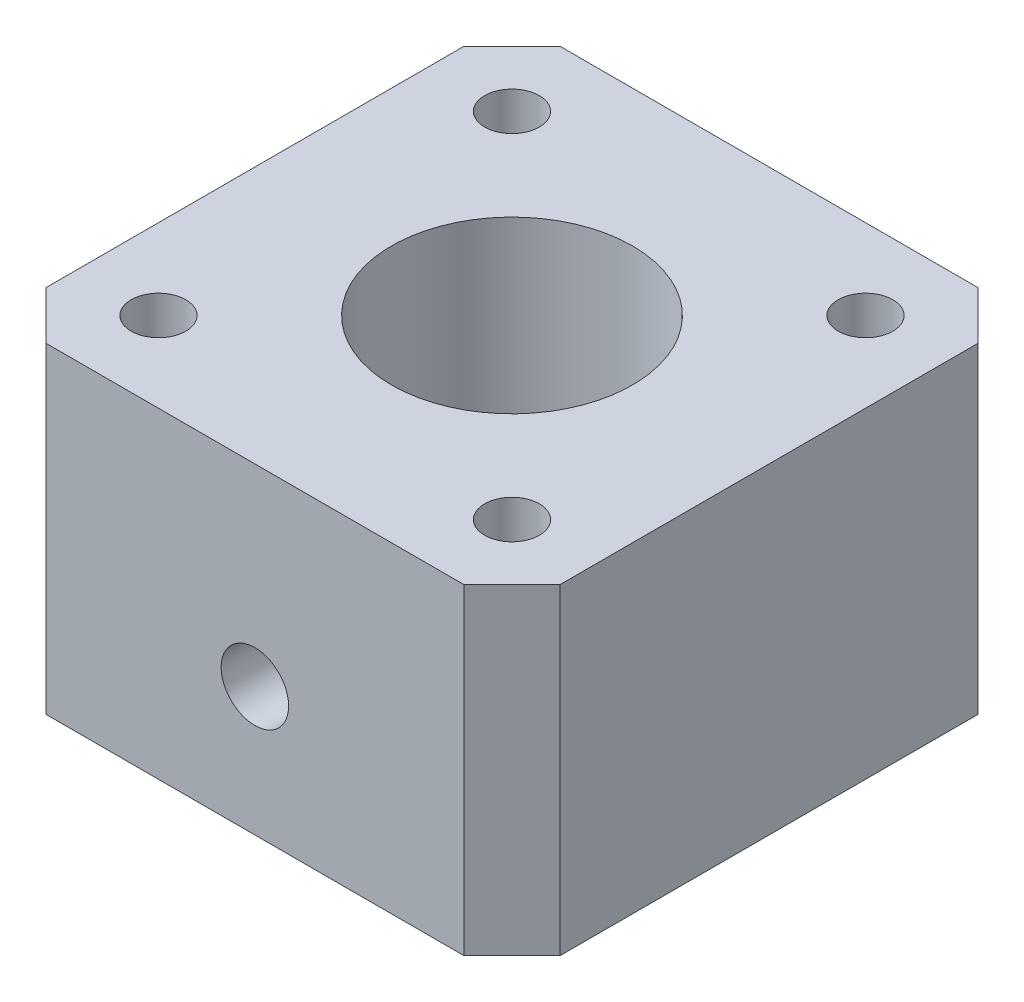
ISO-10303-21;
HEADER;
FILE_DESCRIPTION(('STEP AP214'),'2;1');
FILE_NAME('part.step','',(''),(''),'','','');
FILE_SCHEMA(('AUTOMOTIVE_DESIGN { 1 0 10303 214 1 1 1 1 }'));
ENDSEC;
DATA;
#1=APPLICATION_CONTEXT('core data for automotive mechanical design processes');
#2=APPLICATION_PROTOCOL_DEFINITION('international standard','automotive_design',2000,#1);
#3=PRODUCT_CONTEXT('',#1,'mechanical');
#4=PRODUCT('Part','Part','',(#3));
#5=PRODUCT_RELATED_PRODUCT_CATEGORY('part','',(#4));
#6=PRODUCT_DEFINITION_FORMATION('','',#4);
#7=PRODUCT_DEFINITION_CONTEXT('part definition',#1,'design');
#8=PRODUCT_DEFINITION('design','',#6,#7);
#9=PRODUCT_DEFINITION_SHAPE('','',#8);
#10=(LENGTH_UNIT() NAMED_UNIT(*) SI_UNIT(.MILLI.,.METRE.));
#11=(NAMED_UNIT(*) PLANE_ANGLE_UNIT() SI_UNIT($,.RADIAN.));
#12=(NAMED_UNIT(*) SI_UNIT($,.STERADIAN.) SOLID_ANGLE_UNIT());
#13=UNCERTAINTY_MEASURE_WITH_UNIT(LENGTH_MEASURE(1.E-05),#10,'distance_accuracy_value','');
#14=(GEOMETRIC_REPRESENTATION_CONTEXT(3) GLOBAL_UNCERTAINTY_ASSIGNED_CONTEXT((#13)) GLOBAL_UNIT_ASSIGNED_CONTEXT((#10,
#11,#12)) REPRESENTATION_CONTEXT('',''));
#15=CARTESIAN_POINT('',(0.,0.,0.));
#16=DIRECTION('',(0.,0.,1.));
#17=DIRECTION('',(1.,0.,0.));
#18=AXIS2_PLACEMENT_3D('',#15,#16,#17);
#19=CARTESIAN_POINT('',(0.,20.,0.));
#20=DIRECTION('',(0.,-1.,0.));
#21=DIRECTION('',(0.,0.,-1.));
#22=AXIS2_PLACEMENT_3D('',#19,#20,#21);
#23=PLANE('',#22);
#24=CARTESIAN_POINT('',(11.,20.,11.));
#25=DIRECTION('',(0.,-1.,0.));
#26=DIRECTION('',(0.,0.,-1.));
#27=AXIS2_PLACEMENT_3D('',#24,#25,#26);
#28=CIRCLE('',#27,1.69999999999999);
#29=CARTESIAN_POINT('',(11.,20.,9.3));
#30=VERTEX_POINT('',#29);
#31=EDGE_CURVE('E277',#30,#30,#28,.T.);
#32=ORIENTED_EDGE('',*,*,#31,.T.);
#33=EDGE_LOOP('',(#32));
#34=FACE_BOUND('',#33,.T.);
#35=CARTESIAN_POINT('',(-11.,20.,11.));
#36=DIRECTION('',(0.,-1.,0.));
#37=DIRECTION('',(0.,0.,-1.));
#38=AXIS2_PLACEMENT_3D('',#35,#36,#37);
#39=CIRCLE('',#38,1.69999999999999);
#40=CARTESIAN_POINT('',(-11.,20.,9.3));
#41=VERTEX_POINT('',#40);
#42=EDGE_CURVE('E261',#41,#41,#39,.T.);
#43=ORIENTED_EDGE('',*,*,#42,.T.);
#44=EDGE_LOOP('',(#43));
#45=FACE_BOUND('',#44,.T.);
#46=CARTESIAN_POINT('',(-11.,20.,-11.));
#47=DIRECTION('',(0.,-1.,0.));
#48=DIRECTION('',(0.,0.,-1.));
#49=AXIS2_PLACEMENT_3D('',#46,#47,#48);
#50=CIRCLE('',#49,1.69999999999999);
#51=CARTESIAN_POINT('',(-11.,20.,-12.7));
#52=VERTEX_POINT('',#51);
#53=EDGE_CURVE('E245',#52,#52,#50,.T.);
#54=ORIENTED_EDGE('',*,*,#53,.T.);
#55=EDGE_LOOP('',(#54));
#56=FACE_BOUND('',#55,.T.);
#57=CARTESIAN_POINT('',(11.,20.,-11.));
#58=DIRECTION('',(0.,-1.,0.));
#59=DIRECTION('',(0.,0.,-1.));
#60=AXIS2_PLACEMENT_3D('',#57,#58,#59);
#61=CIRCLE('',#60,1.69999999999999);
#62=CARTESIAN_POINT('',(11.,20.,-12.7));
#63=VERTEX_POINT('',#62);
#64=EDGE_CURVE('E228',#63,#63,#61,.T.);
#65=ORIENTED_EDGE('',*,*,#64,.T.);
#66=EDGE_LOOP('',(#65));
#67=FACE_BOUND('',#66,.T.);
#68=DIRECTION('',(-1.,0.,0.));
#69=VECTOR('',#68,1.);
#70=CARTESIAN_POINT('',(-16.,20.,-16.));
#71=LINE('',#70,#69);
#72=CARTESIAN_POINT('',(13.,20.,-16.));
#73=VERTEX_POINT('',#72);
#74=CARTESIAN_POINT('',(-13.,20.,-16.));
#75=VERTEX_POINT('',#74);
#76=EDGE_CURVE('E220',#73,#75,#71,.T.);
#77=ORIENTED_EDGE('',*,*,#76,.T.);
#78=DIRECTION('',(0.707106781186548,0.,-0.707106781186547));
#79=VECTOR('',#78,1.);
#80=CARTESIAN_POINT('',(-16.,20.,-13.));
#81=LINE('',#80,#79);
#82=CARTESIAN_POINT('',(-16.,20.,-13.));
#83=VERTEX_POINT('',#82);
#84=EDGE_CURVE('E189',#75,#83,#81,.F.);
#85=ORIENTED_EDGE('',*,*,#84,.T.);
#86=DIRECTION('',(0.,0.,1.));
#87=VECTOR('',#86,1.);
#88=CARTESIAN_POINT('',(-16.,20.,16.));
#89=LINE('',#88,#87);
#90=CARTESIAN_POINT('',(-16.,20.,13.));
#91=VERTEX_POINT('',#90);
#92=EDGE_CURVE('E146',#83,#91,#89,.T.);
#93=ORIENTED_EDGE('',*,*,#92,.T.);
#94=DIRECTION('',(-0.707106781186547,0.,-0.707106781186548));
#95=VECTOR('',#94,1.);
#96=CARTESIAN_POINT('',(-13.,20.,16.));
#97=LINE('',#96,#95);
#98=CARTESIAN_POINT('',(-13.,20.,16.));
#99=VERTEX_POINT('',#98);
#100=EDGE_CURVE('E82',#91,#99,#97,.F.);
#101=ORIENTED_EDGE('',*,*,#100,.T.);
#102=DIRECTION('',(1.,0.,0.));
#103=VECTOR('',#102,1.);
#104=CARTESIAN_POINT('',(-16.,20.,16.));
#105=LINE('',#104,#103);
#106=CARTESIAN_POINT('',(13.,20.,16.));
#107=VERTEX_POINT('',#106);
#108=EDGE_CURVE('E167',#99,#107,#105,.T.);
#109=ORIENTED_EDGE('',*,*,#108,.T.);
#110=DIRECTION('',(-0.707106781186549,0.,0.707106781186546));
#111=VECTOR('',#110,1.);
#112=CARTESIAN_POINT('',(16.,20.,13.));
#113=LINE('',#112,#111);
#114=CARTESIAN_POINT('',(16.,20.,13.));
#115=VERTEX_POINT('',#114);
#116=EDGE_CURVE('E181',#107,#115,#113,.F.);
#117=ORIENTED_EDGE('',*,*,#116,.T.);
#118=DIRECTION('',(0.,0.,-1.));
#119=VECTOR('',#118,1.);
#120=CARTESIAN_POINT('',(16.,20.,16.));
#121=LINE('',#120,#119);
#122=CARTESIAN_POINT('',(16.,20.,-13.));
#123=VERTEX_POINT('',#122);
#124=EDGE_CURVE('E160',#115,#123,#121,.T.);
#125=ORIENTED_EDGE('',*,*,#124,.T.);
#126=DIRECTION('',(0.707106781186546,0.,0.707106781186549));
#127=VECTOR('',#126,1.);
#128=CARTESIAN_POINT('',(13.,20.,-16.));
#129=LINE('',#128,#127);
#130=EDGE_CURVE('E184',#123,#73,#129,.F.);
#131=ORIENTED_EDGE('',*,*,#130,.T.);
#132=EDGE_LOOP('',(#77,#85,#93,#101,#109,#117,#125,#131));
#133=FACE_BOUND('',#132,.T.);
#134=CARTESIAN_POINT('',(0.,20.,0.));
#135=DIRECTION('',(0.,1.,0.));
#136=DIRECTION('',(0.,0.,1.));
#137=AXIS2_PLACEMENT_3D('',#134,#135,#136);
#138=CIRCLE('',#137,7.5);
#139=CARTESIAN_POINT('',(0.,20.,7.5));
#140=VERTEX_POINT('',#139);
#141=EDGE_CURVE('E210',#140,#140,#138,.T.);
#142=ORIENTED_EDGE('',*,*,#141,.F.);
#143=EDGE_LOOP('',(#142));
#144=FACE_BOUND('',#143,.T.);
#145=ADVANCED_FACE('F58',(#34,#45,#56,#67,#133,#144),#23,.F.);
#146=CARTESIAN_POINT('',(0.,0.,0.));
#147=DIRECTION('',(0.,-1.,0.));
#148=DIRECTION('',(0.,0.,-1.));
#149=AXIS2_PLACEMENT_3D('',#146,#147,#148);
#150=PLANE('',#149);
#151=CARTESIAN_POINT('',(11.,0.,11.));
#152=DIRECTION('',(0.,-1.,0.));
#153=DIRECTION('',(0.,0.,-1.));
#154=AXIS2_PLACEMENT_3D('',#151,#152,#153);
#155=CIRCLE('',#154,3.25);
#156=CARTESIAN_POINT('',(11.,0.,7.75));
#157=VERTEX_POINT('',#156);
#158=EDGE_CURVE('E289',#157,#157,#155,.T.);
#159=ORIENTED_EDGE('',*,*,#158,.F.);
#160=EDGE_LOOP('',(#159));
#161=FACE_BOUND('',#160,.T.);
#162=CARTESIAN_POINT('',(-11.,0.,11.));
#163=DIRECTION('',(0.,-1.,0.));
#164=DIRECTION('',(0.,0.,-1.));
#165=AXIS2_PLACEMENT_3D('',#162,#163,#164);
#166=CIRCLE('',#165,3.25);
#167=CARTESIAN_POINT('',(-11.,0.,7.75));
#168=VERTEX_POINT('',#167);
#169=EDGE_CURVE('E273',#168,#168,#166,.T.);
#170=ORIENTED_EDGE('',*,*,#169,.F.);
#171=EDGE_LOOP('',(#170));
#172=FACE_BOUND('',#171,.T.);
#173=CARTESIAN_POINT('',(-11.,0.,-11.));
#174=DIRECTION('',(0.,-1.,0.));
#175=DIRECTION('',(0.,0.,-1.));
#176=AXIS2_PLACEMENT_3D('',#173,#174,#175);
#177=CIRCLE('',#176,3.25);
#178=CARTESIAN_POINT('',(-11.,0.,-14.25));
#179=VERTEX_POINT('',#178);
#180=EDGE_CURVE('E257',#179,#179,#177,.T.);
#181=ORIENTED_EDGE('',*,*,#180,.F.);
#182=EDGE_LOOP('',(#181));
#183=FACE_BOUND('',#182,.T.);
#184=CARTESIAN_POINT('',(11.,0.,-11.));
#185=DIRECTION('',(0.,-1.,0.));
#186=DIRECTION('',(0.,0.,-1.));
#187=AXIS2_PLACEMENT_3D('',#184,#185,#186);
#188=CIRCLE('',#187,3.25);
#189=CARTESIAN_POINT('',(11.,0.,-14.25));
#190=VERTEX_POINT('',#189);
#191=EDGE_CURVE('E241',#190,#190,#188,.T.);
#192=ORIENTED_EDGE('',*,*,#191,.F.);
#193=EDGE_LOOP('',(#192));
#194=FACE_BOUND('',#193,.T.);
#195=DIRECTION('',(0.,0.,1.));
#196=VECTOR('',#195,1.);
#197=CARTESIAN_POINT('',(-16.,0.,16.));
#198=LINE('',#197,#196);
#199=CARTESIAN_POINT('',(-16.,0.,-13.));
#200=VERTEX_POINT('',#199);
#201=CARTESIAN_POINT('',(-16.,0.,13.));
#202=VERTEX_POINT('',#201);
#203=EDGE_CURVE('E144',#200,#202,#198,.T.);
#204=ORIENTED_EDGE('',*,*,#203,.F.);
#205=DIRECTION('',(-0.707106781186548,0.,0.707106781186547));
#206=VECTOR('',#205,1.);
#207=CARTESIAN_POINT('',(-14.5,0.,-14.5));
#208=LINE('',#207,#206);
#209=CARTESIAN_POINT('',(-13.,0.,-16.));
#210=VERTEX_POINT('',#209);
#211=EDGE_CURVE('E126',#200,#210,#208,.F.);
#212=ORIENTED_EDGE('',*,*,#211,.T.);
#213=DIRECTION('',(-1.,0.,0.));
#214=VECTOR('',#213,1.);
#215=CARTESIAN_POINT('',(-16.,0.,-16.));
#216=LINE('',#215,#214);
#217=CARTESIAN_POINT('',(13.,0.,-16.));
#218=VERTEX_POINT('',#217);
#219=EDGE_CURVE('E156',#218,#210,#216,.T.);
#220=ORIENTED_EDGE('',*,*,#219,.F.);
#221=DIRECTION('',(-0.707106781186546,0.,-0.707106781186549));
#222=VECTOR('',#221,1.);
#223=CARTESIAN_POINT('',(14.5,0.,-14.5));
#224=LINE('',#223,#222);
#225=CARTESIAN_POINT('',(16.,0.,-13.));
#226=VERTEX_POINT('',#225);
#227=EDGE_CURVE('E171',#218,#226,#224,.F.);
#228=ORIENTED_EDGE('',*,*,#227,.T.);
#229=DIRECTION('',(0.,0.,-1.));
#230=VECTOR('',#229,1.);
#231=CARTESIAN_POINT('',(16.,0.,16.));
#232=LINE('',#231,#230);
#233=CARTESIAN_POINT('',(16.,0.,13.));
#234=VERTEX_POINT('',#233);
#235=EDGE_CURVE('E162',#234,#226,#232,.T.);
#236=ORIENTED_EDGE('',*,*,#235,.F.);
#237=DIRECTION('',(0.707106781186549,0.,-0.707106781186546));
#238=VECTOR('',#237,1.);
#239=CARTESIAN_POINT('',(14.5,0.,14.5));
#240=LINE('',#239,#238);
#241=CARTESIAN_POINT('',(13.,0.,16.));
#242=VERTEX_POINT('',#241);
#243=EDGE_CURVE('E148',#234,#242,#240,.F.);
#244=ORIENTED_EDGE('',*,*,#243,.T.);
#245=DIRECTION('',(1.,0.,0.));
#246=VECTOR('',#245,1.);
#247=CARTESIAN_POINT('',(-16.,0.,16.));
#248=LINE('',#247,#246);
#249=CARTESIAN_POINT('',(-13.,0.,16.));
#250=VERTEX_POINT('',#249);
#251=EDGE_CURVE('E155',#250,#242,#248,.T.);
#252=ORIENTED_EDGE('',*,*,#251,.F.);
#253=DIRECTION('',(0.707106781186547,0.,0.707106781186548));
#254=VECTOR('',#253,1.);
#255=CARTESIAN_POINT('',(-14.5,0.,14.5));
#256=LINE('',#255,#254);
#257=EDGE_CURVE('E138',#250,#202,#256,.F.);
#258=ORIENTED_EDGE('',*,*,#257,.T.);
#259=EDGE_LOOP('',(#204,#212,#220,#228,#236,#244,#252,#258));
#260=FACE_BOUND('',#259,.T.);
#261=CARTESIAN_POINT('',(0.,0.,0.));
#262=DIRECTION('',(0.,1.,0.));
#263=DIRECTION('',(0.,0.,1.));
#264=AXIS2_PLACEMENT_3D('',#261,#262,#263);
#265=CIRCLE('',#264,7.5);
#266=CARTESIAN_POINT('',(0.,0.,7.5));
#267=VERTEX_POINT('',#266);
#268=EDGE_CURVE('E213',#267,#267,#265,.T.);
#269=ORIENTED_EDGE('',*,*,#268,.T.);
#270=EDGE_LOOP('',(#269));
#271=FACE_BOUND('',#270,.T.);
#272=ADVANCED_FACE('F151',(#161,#172,#183,#194,#260,#271),#150,.T.);
#273=CARTESIAN_POINT('',(16.,20.,16.));
#274=DIRECTION('',(-1.,0.,0.));
#275=DIRECTION('',(0.,0.,1.));
#276=AXIS2_PLACEMENT_3D('',#273,#274,#275);
#277=PLANE('',#276);
#278=ORIENTED_EDGE('',*,*,#235,.T.);
#279=DIRECTION('',(0.,1.,0.));
#280=VECTOR('',#279,1.);
#281=CARTESIAN_POINT('',(16.,20.,-13.));
#282=LINE('',#281,#280);
#283=EDGE_CURVE('E11',#226,#123,#282,.T.);
#284=ORIENTED_EDGE('',*,*,#283,.T.);
#285=ORIENTED_EDGE('',*,*,#124,.F.);
#286=DIRECTION('',(0.,-1.,0.));
#287=VECTOR('',#286,1.);
#288=CARTESIAN_POINT('',(16.,20.,13.));
#289=LINE('',#288,#287);
#290=EDGE_CURVE('E68',#115,#234,#289,.T.);
#291=ORIENTED_EDGE('',*,*,#290,.T.);
#292=EDGE_LOOP('',(#278,#284,#285,#291));
#293=FACE_BOUND('',#292,.T.);
#294=ADVANCED_FACE('F204',(#293),#277,.F.);
#295=CARTESIAN_POINT('',(-16.,20.,-16.));
#296=DIRECTION('',(0.,0.,1.));
#297=DIRECTION('',(1.,0.,0.));
#298=AXIS2_PLACEMENT_3D('',#295,#296,#297);
#299=PLANE('',#298);
#300=ORIENTED_EDGE('',*,*,#219,.T.);
#301=DIRECTION('',(0.,1.,0.));
#302=VECTOR('',#301,1.);
#303=CARTESIAN_POINT('',(-13.,20.,-16.));
#304=LINE('',#303,#302);
#305=EDGE_CURVE('E131',#210,#75,#304,.T.);
#306=ORIENTED_EDGE('',*,*,#305,.T.);
#307=ORIENTED_EDGE('',*,*,#76,.F.);
#308=DIRECTION('',(0.,-1.,0.));
#309=VECTOR('',#308,1.);
#310=CARTESIAN_POINT('',(13.,20.,-16.));
#311=LINE('',#310,#309);
#312=EDGE_CURVE('E137',#73,#218,#311,.T.);
#313=ORIENTED_EDGE('',*,*,#312,.T.);
#314=EDGE_LOOP('',(#300,#306,#307,#313));
#315=FACE_BOUND('',#314,.T.);
#316=ADVANCED_FACE('F340',(#315),#299,.F.);
#317=CARTESIAN_POINT('',(-16.,20.,16.));
#318=DIRECTION('',(1.,0.,0.));
#319=DIRECTION('',(0.,0.,-1.));
#320=AXIS2_PLACEMENT_3D('',#317,#318,#319);
#321=PLANE('',#320);
#322=ORIENTED_EDGE('',*,*,#92,.F.);
#323=DIRECTION('',(0.,-1.,0.));
#324=VECTOR('',#323,1.);
#325=CARTESIAN_POINT('',(-16.,20.,-13.));
#326=LINE('',#325,#324);
#327=EDGE_CURVE('E130',#83,#200,#326,.T.);
#328=ORIENTED_EDGE('',*,*,#327,.T.);
#329=ORIENTED_EDGE('',*,*,#203,.T.);
#330=DIRECTION('',(0.,1.,0.));
#331=VECTOR('',#330,1.);
#332=CARTESIAN_POINT('',(-16.,20.,13.));
#333=LINE('',#332,#331);
#334=EDGE_CURVE('E149',#202,#91,#333,.T.);
#335=ORIENTED_EDGE('',*,*,#334,.T.);
#336=EDGE_LOOP('',(#322,#328,#329,#335));
#337=FACE_BOUND('',#336,.T.);
#338=ADVANCED_FACE('F143',(#337),#321,.F.);
#339=CARTESIAN_POINT('',(-16.,20.,16.));
#340=DIRECTION('',(0.,0.,-1.));
#341=DIRECTION('',(-1.,0.,0.));
#342=AXIS2_PLACEMENT_3D('',#339,#340,#341);
#343=PLANE('',#342);
#344=CARTESIAN_POINT('',(0.,8.,16.));
#345=DIRECTION('',(0.,0.,1.));
#346=DIRECTION('',(1.,0.,0.));
#347=AXIS2_PLACEMENT_3D('',#344,#345,#346);
#348=CIRCLE('',#347,2.1);
#349=CARTESIAN_POINT('',(2.1,8.,16.));
#350=VERTEX_POINT('',#349);
#351=EDGE_CURVE('E302',#350,#350,#348,.T.);
#352=ORIENTED_EDGE('',*,*,#351,.F.);
#353=EDGE_LOOP('',(#352));
#354=FACE_BOUND('',#353,.T.);
#355=ORIENTED_EDGE('',*,*,#108,.F.);
#356=DIRECTION('',(0.,-1.,0.));
#357=VECTOR('',#356,1.);
#358=CARTESIAN_POINT('',(-13.,20.,16.));
#359=LINE('',#358,#357);
#360=EDGE_CURVE('E194',#99,#250,#359,.T.);
#361=ORIENTED_EDGE('',*,*,#360,.T.);
#362=ORIENTED_EDGE('',*,*,#251,.T.);
#363=DIRECTION('',(0.,1.,0.));
#364=VECTOR('',#363,1.);
#365=CARTESIAN_POINT('',(13.,20.,16.));
#366=LINE('',#365,#364);
#367=EDGE_CURVE('E75',#242,#107,#366,.T.);
#368=ORIENTED_EDGE('',*,*,#367,.T.);
#369=EDGE_LOOP('',(#355,#361,#362,#368));
#370=FACE_BOUND('',#369,.T.);
#371=ADVANCED_FACE('F334',(#354,#370),#343,.F.);
#372=CARTESIAN_POINT('',(0.,20.,0.));
#373=DIRECTION('',(0.,-1.,0.));
#374=DIRECTION('',(0.,0.,-1.));
#375=AXIS2_PLACEMENT_3D('',#372,#373,#374);
#376=CYLINDRICAL_SURFACE('',#375,7.5);
#377=CARTESIAN_POINT('',(2.1,8.,7.2));
#378=CARTESIAN_POINT('',(2.09999769142372,7.88455110517133,7.2000017509261));
#379=CARTESIAN_POINT('',(2.09044725800801,7.76907857532073,7.20280713265303));
#380=CARTESIAN_POINT('',(2.05258019102824,7.54148428755021,7.21368770991473));
#381=CARTESIAN_POINT('',(2.02425538445371,7.42936401118606,7.22176520052275));
#382=CARTESIAN_POINT('',(1.94985652031882,7.21180023988364,7.24220502233453));
#383=CARTESIAN_POINT('',(1.90380916683966,7.10634697618715,7.25456090412264));
#384=CARTESIAN_POINT('',(1.79535769220004,6.90464207606648,7.28215690109494));
#385=CARTESIAN_POINT('',(1.73295183131605,6.80839141982424,7.29739732300137));
#386=CARTESIAN_POINT('',(1.59171413202466,6.62517052416384,7.32951618449187));
#387=CARTESIAN_POINT('',(1.51251149606311,6.53849155407776,7.34642599336529));
#388=CARTESIAN_POINT('',(1.34072490285876,6.3794568479917,7.3797086675302));
#389=CARTESIAN_POINT('',(1.24813943745967,6.30710272848815,7.39608147204938));
#390=CARTESIAN_POINT('',(1.05017536418181,6.177537651625,7.42679785762244));
#391=CARTESIAN_POINT('',(0.944598390212246,6.12061913539018,7.44110013563312));
#392=CARTESIAN_POINT('',(0.724904746771353,6.02545309176847,7.46570231446394));
#393=CARTESIAN_POINT('',(0.610789675797226,5.98720207950076,7.4760029622418));
#394=CARTESIAN_POINT('',(0.380302236373027,5.93140772474192,7.49121941354851));
#395=CARTESIAN_POINT('',(0.264058623362756,5.91336823938435,7.49626401123116));
#396=CARTESIAN_POINT('',(0.03009274600881,5.89694502126617,7.50085154395726));
#397=CARTESIAN_POINT('',(-0.0876292425050775,5.89855767475153,7.50039549049382));
#398=CARTESIAN_POINT('',(-0.31774631151863,5.92104988331973,7.49412619131461));
#399=CARTESIAN_POINT('',(-0.430198522887031,5.94139293966687,7.48846212582118));
#400=CARTESIAN_POINT('',(-0.650024177765255,5.99989803930804,7.47259127690994));
#401=CARTESIAN_POINT('',(-0.757397317354171,6.03806114743458,7.4623842220287));
#402=CARTESIAN_POINT('',(-0.965349801263521,6.13151539355546,7.43835884069074));
#403=CARTESIAN_POINT('',(-1.06584470618675,6.18698444930544,7.42450324668395));
#404=CARTESIAN_POINT('',(-1.25627862457918,6.31333795993753,7.39466485562083));
#405=CARTESIAN_POINT('',(-1.34621539544035,6.38422568074331,7.37868160817165));
#406=CARTESIAN_POINT('',(-1.51618305590153,6.54222754355347,7.34567522057905));
#407=CARTESIAN_POINT('',(-1.59577717509012,6.62980858410341,7.32863518998309));
#408=CARTESIAN_POINT('',(-1.73926156835205,6.81724868645204,7.29591665217891));
#409=CARTESIAN_POINT('',(-1.80315067068666,6.91710866353899,7.28023824661686));
#410=CARTESIAN_POINT('',(-1.91379030231589,7.12729666999599,7.25194501002576));
#411=CARTESIAN_POINT('',(-1.96041048527216,7.23769670572155,7.23935371206725));
#412=CARTESIAN_POINT('',(-2.03427979371574,7.46521055278396,7.21894665875122));
#413=CARTESIAN_POINT('',(-2.06153429654469,7.58232249063324,7.21112957780356));
#414=CARTESIAN_POINT('',(-2.09512133703559,7.8158226539633,7.20144181427927));
#415=CARTESIAN_POINT('',(-2.10211023295227,7.93210882732001,7.19938465899453));
#416=CARTESIAN_POINT('',(-2.09678562260949,8.16419067902114,7.20093733719562));
#417=CARTESIAN_POINT('',(-2.08447441367736,8.2799864140983,7.20454649620961));
#418=CARTESIAN_POINT('',(-2.04148011473316,8.50519211196121,7.21684386770043));
#419=CARTESIAN_POINT('',(-2.01120230768185,8.61468617743715,7.22541993924817));
#420=CARTESIAN_POINT('',(-1.93359543214541,8.827038759286,7.24657269498034));
#421=CARTESIAN_POINT('',(-1.88626397295672,8.92989634292426,7.2591499400491));
#422=CARTESIAN_POINT('',(-1.77459509136294,9.12877269761775,7.28726240690147));
#423=CARTESIAN_POINT('',(-1.70987813502039,9.224569166007,7.30286116048027));
#424=CARTESIAN_POINT('',(-1.56573803326783,9.40418314643846,7.33511474861878));
#425=CARTESIAN_POINT('',(-1.48631183008104,9.48799816133002,7.35176980228926));
#426=CARTESIAN_POINT('',(-1.31195238316687,9.64405083657379,7.38490975407121));
#427=CARTESIAN_POINT('',(-1.21660153256647,9.71582776949724,7.4013718288206));
#428=CARTESIAN_POINT('',(-1.01482822512431,9.84236295569935,7.43172364179825));
#429=CARTESIAN_POINT('',(-0.908406353625253,9.8971221081257,7.44561351591507));
#430=CARTESIAN_POINT('',(-0.688255620931217,9.98754923511424,7.46916678636433));
#431=CARTESIAN_POINT('',(-0.574589642969954,10.0233615963978,7.47886204186584));
#432=CARTESIAN_POINT('',(-0.342537614831906,10.0752817885412,7.4930742926061));
#433=CARTESIAN_POINT('',(-0.224152734238768,10.0913944710087,7.49759256280785));
#434=CARTESIAN_POINT('',(0.00969112124072454,10.10312839472,7.50087475153957));
#435=CARTESIAN_POINT('',(0.125114144971011,10.0994223040454,7.49982757425403));
#436=CARTESIAN_POINT('',(0.353626881036671,10.0732036113851,7.49253071356722));
#437=CARTESIAN_POINT('',(0.46671669725485,10.0506918485554,7.48628126230442));
#438=CARTESIAN_POINT('',(0.686456269375142,9.98789613958341,7.46932613881606));
#439=CARTESIAN_POINT('',(0.793151611784457,9.94776095431702,7.4586578085919));
#440=CARTESIAN_POINT('',(0.998353701041718,9.85098998719995,7.43397489084362));
#441=CARTESIAN_POINT('',(1.09685921135807,9.79435171944605,7.41995979924538));
#442=CARTESIAN_POINT('',(1.28596610763476,9.66428300177141,7.38956927564245));
#443=CARTESIAN_POINT('',(1.37625788128737,9.59041564694985,7.37313745973981));
#444=CARTESIAN_POINT('',(1.54339107601341,9.42879782153954,7.33997403900929));
#445=CARTESIAN_POINT('',(1.6202288270092,9.34104357518203,7.32324235374892));
#446=CARTESIAN_POINT('',(1.7601810081138,9.15151287771815,7.29088892650894));
#447=CARTESIAN_POINT('',(1.82290552428642,9.04944137267979,7.27530525828303));
#448=CARTESIAN_POINT('',(1.93021956053794,8.83577800875939,7.24757503896698));
#449=CARTESIAN_POINT('',(1.97481976673699,8.72419180685135,7.23542646383001));
#450=CARTESIAN_POINT('',(2.03947300884321,8.51101715035091,7.21744457121269));
#451=CARTESIAN_POINT('',(2.0621139131252,8.41026176112713,7.21095909202012));
#452=CARTESIAN_POINT('',(2.09237736458971,8.20634364291427,7.20223632826997));
#453=CARTESIAN_POINT('',(2.10000206326628,8.10318126093812,7.19999843512782));
#454=CARTESIAN_POINT('',(2.1,8.,7.2));
#455=B_SPLINE_CURVE_WITH_KNOTS('',3,(#377,#378,#379,#380,#381,#382,#383,#384,#385,#386,#387,
#388,#389,#390,#391,#392,#393,#394,#395,#396,#397,#398,#399,#400,#401,#402,#403,#404,#405,#406,
#407,#408,#409,#410,#411,#412,#413,#414,#415,#416,#417,#418,#419,#420,#421,#422,#423,#424,#425,
#426,#427,#428,#429,#430,#431,#432,#433,#434,#435,#436,#437,#438,#439,#440,#441,#442,#443,#444,
#445,#446,#447,#448,#449,#450,#451,#452,#453,#454),.UNSPECIFIED.,.T.,.F.,(4,2,2,2,2,2,2,2,2,2,2,
2,2,2,2,2,2,2,2,2,2,2,2,2,2,2,2,2,2,2,2,2,2,2,2,2,2,2,4),(0.,0.345966820679477,
0.692084349409679,1.03768238213021,1.3833171840449,1.73757082880147,2.09186442676818,
2.45246381411618,2.81299585839309,3.1644693582517,3.51587822801511,3.85752460211593,
4.19919139381877,4.54449343533439,4.88986868878041,5.24690042870958,5.60395879841149,
5.96365984094947,6.3232609648655,6.67107770948495,7.01885305597464,7.35906666926102,
7.69932799470604,8.0477245112009,8.39619353426625,8.7559044767484,9.11559641039042,
9.47250627059271,9.82932821384833,10.1741178008124,10.5188920032276,10.8608102624592,
11.202780052397,11.5546053491271,11.9065264700836,12.2672217164641,12.627703986753,
12.9369525819905,13.2461568654393),.UNSPECIFIED.);
#456=CARTESIAN_POINT('',(2.1,8.,7.2));
#457=VERTEX_POINT('',#456);
#458=EDGE_CURVE('E293',#457,#457,#455,.T.);
#459=ORIENTED_EDGE('',*,*,#458,.F.);
#460=EDGE_LOOP('',(#459));
#461=FACE_BOUND('',#460,.T.);
#462=ORIENTED_EDGE('',*,*,#141,.T.);
#463=EDGE_LOOP('',(#462));
#464=FACE_BOUND('',#463,.T.);
#465=ORIENTED_EDGE('',*,*,#268,.F.);
#466=EDGE_LOOP('',(#465));
#467=FACE_BOUND('',#466,.T.);
#468=ADVANCED_FACE('F331',(#461,#464,#467),#376,.F.);
#469=CARTESIAN_POINT('',(11.,0.,-11.));
#470=DIRECTION('',(0.,-1.,0.));
#471=DIRECTION('',(0.,0.,-1.));
#472=AXIS2_PLACEMENT_3D('',#469,#470,#471);
#473=CYLINDRICAL_SURFACE('',#472,1.7);
#474=ORIENTED_EDGE('',*,*,#64,.F.);
#475=EDGE_LOOP('',(#474));
#476=FACE_BOUND('',#475,.T.);
#477=CARTESIAN_POINT('',(11.,3.,-11.));
#478=DIRECTION('',(0.,-1.,0.));
#479=DIRECTION('',(0.,0.,-1.));
#480=AXIS2_PLACEMENT_3D('',#477,#478,#479);
#481=CIRCLE('',#480,1.7);
#482=CARTESIAN_POINT('',(11.,3.,-12.7));
#483=VERTEX_POINT('',#482);
#484=EDGE_CURVE('E233',#483,#483,#481,.T.);
#485=ORIENTED_EDGE('',*,*,#484,.T.);
#486=EDGE_LOOP('',(#485));
#487=FACE_BOUND('',#486,.T.);
#488=ADVANCED_FACE('F372',(#476,#487),#473,.F.);
#489=CARTESIAN_POINT('',(12.7,3.,-11.));
#490=DIRECTION('',(0.,1.,0.));
#491=DIRECTION('',(0.,0.,1.));
#492=AXIS2_PLACEMENT_3D('',#489,#490,#491);
#493=PLANE('',#492);
#494=ORIENTED_EDGE('',*,*,#484,.F.);
#495=EDGE_LOOP('',(#494));
#496=FACE_BOUND('',#495,.T.);
#497=CARTESIAN_POINT('',(11.,3.,-11.));
#498=DIRECTION('',(0.,-1.,0.));
#499=DIRECTION('',(0.,0.,-1.));
#500=AXIS2_PLACEMENT_3D('',#497,#498,#499);
#501=CIRCLE('',#500,3.25);
#502=CARTESIAN_POINT('',(11.,3.,-14.25));
#503=VERTEX_POINT('',#502);
#504=EDGE_CURVE('E237',#503,#503,#501,.T.);
#505=ORIENTED_EDGE('',*,*,#504,.T.);
#506=EDGE_LOOP('',(#505));
#507=FACE_BOUND('',#506,.T.);
#508=ADVANCED_FACE('F378',(#496,#507),#493,.F.);
#509=CARTESIAN_POINT('',(11.,0.,-11.));
#510=DIRECTION('',(0.,-1.,0.));
#511=DIRECTION('',(0.,0.,-1.));
#512=AXIS2_PLACEMENT_3D('',#509,#510,#511);
#513=CYLINDRICAL_SURFACE('',#512,3.25);
#514=ORIENTED_EDGE('',*,*,#504,.F.);
#515=EDGE_LOOP('',(#514));
#516=FACE_BOUND('',#515,.T.);
#517=ORIENTED_EDGE('',*,*,#191,.T.);
#518=EDGE_LOOP('',(#517));
#519=FACE_BOUND('',#518,.T.);
#520=ADVANCED_FACE('F384',(#516,#519),#513,.F.);
#521=CARTESIAN_POINT('',(-11.,0.,-11.));
#522=DIRECTION('',(0.,-1.,0.));
#523=DIRECTION('',(0.,0.,-1.));
#524=AXIS2_PLACEMENT_3D('',#521,#522,#523);
#525=CYLINDRICAL_SURFACE('',#524,1.7);
#526=ORIENTED_EDGE('',*,*,#53,.F.);
#527=EDGE_LOOP('',(#526));
#528=FACE_BOUND('',#527,.T.);
#529=CARTESIAN_POINT('',(-11.,3.,-11.));
#530=DIRECTION('',(0.,-1.,0.));
#531=DIRECTION('',(0.,0.,-1.));
#532=AXIS2_PLACEMENT_3D('',#529,#530,#531);
#533=CIRCLE('',#532,1.7);
#534=CARTESIAN_POINT('',(-11.,3.,-12.7));
#535=VERTEX_POINT('',#534);
#536=EDGE_CURVE('E249',#535,#535,#533,.T.);
#537=ORIENTED_EDGE('',*,*,#536,.T.);
#538=EDGE_LOOP('',(#537));
#539=FACE_BOUND('',#538,.T.);
#540=ADVANCED_FACE('F392',(#528,#539),#525,.F.);
#541=CARTESIAN_POINT('',(-9.3,3.,-11.));
#542=DIRECTION('',(0.,1.,0.));
#543=DIRECTION('',(0.,0.,1.));
#544=AXIS2_PLACEMENT_3D('',#541,#542,#543);
#545=PLANE('',#544);
#546=ORIENTED_EDGE('',*,*,#536,.F.);
#547=EDGE_LOOP('',(#546));
#548=FACE_BOUND('',#547,.T.);
#549=CARTESIAN_POINT('',(-11.,3.,-11.));
#550=DIRECTION('',(0.,-1.,0.));
#551=DIRECTION('',(0.,0.,-1.));
#552=AXIS2_PLACEMENT_3D('',#549,#550,#551);
#553=CIRCLE('',#552,3.25);
#554=CARTESIAN_POINT('',(-11.,3.,-14.25));
#555=VERTEX_POINT('',#554);
#556=EDGE_CURVE('E253',#555,#555,#553,.T.);
#557=ORIENTED_EDGE('',*,*,#556,.T.);
#558=EDGE_LOOP('',(#557));
#559=FACE_BOUND('',#558,.T.);
#560=ADVANCED_FACE('F396',(#548,#559),#545,.F.);
#561=CARTESIAN_POINT('',(-11.,0.,-11.));
#562=DIRECTION('',(0.,-1.,0.));
#563=DIRECTION('',(0.,0.,-1.));
#564=AXIS2_PLACEMENT_3D('',#561,#562,#563);
#565=CYLINDRICAL_SURFACE('',#564,3.25);
#566=ORIENTED_EDGE('',*,*,#556,.F.);
#567=EDGE_LOOP('',(#566));
#568=FACE_BOUND('',#567,.T.);
#569=ORIENTED_EDGE('',*,*,#180,.T.);
#570=EDGE_LOOP('',(#569));
#571=FACE_BOUND('',#570,.T.);
#572=ADVANCED_FACE('F400',(#568,#571),#565,.F.);
#573=CARTESIAN_POINT('',(-11.,0.,11.));
#574=DIRECTION('',(0.,-1.,0.));
#575=DIRECTION('',(0.,0.,-1.));
#576=AXIS2_PLACEMENT_3D('',#573,#574,#575);
#577=CYLINDRICAL_SURFACE('',#576,1.7);
#578=ORIENTED_EDGE('',*,*,#42,.F.);
#579=EDGE_LOOP('',(#578));
#580=FACE_BOUND('',#579,.T.);
#581=CARTESIAN_POINT('',(-11.,3.,11.));
#582=DIRECTION('',(0.,-1.,0.));
#583=DIRECTION('',(0.,0.,-1.));
#584=AXIS2_PLACEMENT_3D('',#581,#582,#583);
#585=CIRCLE('',#584,1.7);
#586=CARTESIAN_POINT('',(-11.,3.,9.29999999999999));
#587=VERTEX_POINT('',#586);
#588=EDGE_CURVE('E265',#587,#587,#585,.T.);
#589=ORIENTED_EDGE('',*,*,#588,.T.);
#590=EDGE_LOOP('',(#589));
#591=FACE_BOUND('',#590,.T.);
#592=ADVANCED_FACE('F404',(#580,#591),#577,.F.);
#593=CARTESIAN_POINT('',(-9.29999999999999,3.,11.));
#594=DIRECTION('',(0.,1.,0.));
#595=DIRECTION('',(0.,0.,1.));
#596=AXIS2_PLACEMENT_3D('',#593,#594,#595);
#597=PLANE('',#596);
#598=ORIENTED_EDGE('',*,*,#588,.F.);
#599=EDGE_LOOP('',(#598));
#600=FACE_BOUND('',#599,.T.);
#601=CARTESIAN_POINT('',(-11.,3.,11.));
#602=DIRECTION('',(0.,-1.,0.));
#603=DIRECTION('',(0.,0.,-1.));
#604=AXIS2_PLACEMENT_3D('',#601,#602,#603);
#605=CIRCLE('',#604,3.25);
#606=CARTESIAN_POINT('',(-11.,3.,7.75));
#607=VERTEX_POINT('',#606);
#608=EDGE_CURVE('E269',#607,#607,#605,.T.);
#609=ORIENTED_EDGE('',*,*,#608,.T.);
#610=EDGE_LOOP('',(#609));
#611=FACE_BOUND('',#610,.T.);
#612=ADVANCED_FACE('F408',(#600,#611),#597,.F.);
#613=CARTESIAN_POINT('',(-11.,0.,11.));
#614=DIRECTION('',(0.,-1.,0.));
#615=DIRECTION('',(0.,0.,-1.));
#616=AXIS2_PLACEMENT_3D('',#613,#614,#615);
#617=CYLINDRICAL_SURFACE('',#616,3.25);
#618=ORIENTED_EDGE('',*,*,#608,.F.);
#619=EDGE_LOOP('',(#618));
#620=FACE_BOUND('',#619,.T.);
#621=ORIENTED_EDGE('',*,*,#169,.T.);
#622=EDGE_LOOP('',(#621));
#623=FACE_BOUND('',#622,.T.);
#624=ADVANCED_FACE('F412',(#620,#623),#617,.F.);
#625=CARTESIAN_POINT('',(11.,0.,11.));
#626=DIRECTION('',(0.,-1.,0.));
#627=DIRECTION('',(0.,0.,-1.));
#628=AXIS2_PLACEMENT_3D('',#625,#626,#627);
#629=CYLINDRICAL_SURFACE('',#628,1.7);
#630=ORIENTED_EDGE('',*,*,#31,.F.);
#631=EDGE_LOOP('',(#630));
#632=FACE_BOUND('',#631,.T.);
#633=CARTESIAN_POINT('',(11.,3.,11.));
#634=DIRECTION('',(0.,-1.,0.));
#635=DIRECTION('',(0.,0.,-1.));
#636=AXIS2_PLACEMENT_3D('',#633,#634,#635);
#637=CIRCLE('',#636,1.7);
#638=CARTESIAN_POINT('',(11.,3.,9.29999999999999));
#639=VERTEX_POINT('',#638);
#640=EDGE_CURVE('E281',#639,#639,#637,.T.);
#641=ORIENTED_EDGE('',*,*,#640,.T.);
#642=EDGE_LOOP('',(#641));
#643=FACE_BOUND('',#642,.T.);
#644=ADVANCED_FACE('F416',(#632,#643),#629,.F.);
#645=CARTESIAN_POINT('',(12.7,3.,11.));
#646=DIRECTION('',(0.,1.,0.));
#647=DIRECTION('',(0.,0.,1.));
#648=AXIS2_PLACEMENT_3D('',#645,#646,#647);
#649=PLANE('',#648);
#650=ORIENTED_EDGE('',*,*,#640,.F.);
#651=EDGE_LOOP('',(#650));
#652=FACE_BOUND('',#651,.T.);
#653=CARTESIAN_POINT('',(11.,3.,11.));
#654=DIRECTION('',(0.,-1.,0.));
#655=DIRECTION('',(0.,0.,-1.));
#656=AXIS2_PLACEMENT_3D('',#653,#654,#655);
#657=CIRCLE('',#656,3.25);
#658=CARTESIAN_POINT('',(11.,3.,7.75));
#659=VERTEX_POINT('',#658);
#660=EDGE_CURVE('E285',#659,#659,#657,.T.);
#661=ORIENTED_EDGE('',*,*,#660,.T.);
#662=EDGE_LOOP('',(#661));
#663=FACE_BOUND('',#662,.T.);
#664=ADVANCED_FACE('F316',(#652,#663),#649,.F.);
#665=CARTESIAN_POINT('',(11.,0.,11.));
#666=DIRECTION('',(0.,-1.,0.));
#667=DIRECTION('',(0.,0.,-1.));
#668=AXIS2_PLACEMENT_3D('',#665,#666,#667);
#669=CYLINDRICAL_SURFACE('',#668,3.25);
#670=ORIENTED_EDGE('',*,*,#660,.F.);
#671=EDGE_LOOP('',(#670));
#672=FACE_BOUND('',#671,.T.);
#673=ORIENTED_EDGE('',*,*,#158,.T.);
#674=EDGE_LOOP('',(#673));
#675=FACE_BOUND('',#674,.T.);
#676=ADVANCED_FACE('F308',(#672,#675),#669,.F.);
#677=CARTESIAN_POINT('',(0.,8.,16.));
#678=DIRECTION('',(0.,0.,1.));
#679=DIRECTION('',(1.,0.,0.));
#680=AXIS2_PLACEMENT_3D('',#677,#678,#679);
#681=CYLINDRICAL_SURFACE('',#680,2.1);
#682=ORIENTED_EDGE('',*,*,#351,.T.);
#683=EDGE_LOOP('',(#682));
#684=FACE_BOUND('',#683,.T.);
#685=ORIENTED_EDGE('',*,*,#458,.T.);
#686=EDGE_LOOP('',(#685));
#687=FACE_BOUND('',#686,.T.);
#688=ADVANCED_FACE('F305',(#684,#687),#681,.F.);
#689=CARTESIAN_POINT('',(-16.,20.,-13.));
#690=DIRECTION('',(0.707106781186547,0.,0.707106781186548));
#691=DIRECTION('',(0.,-1.,0.));
#692=AXIS2_PLACEMENT_3D('',#689,#690,#691);
#693=PLANE('',#692);
#694=ORIENTED_EDGE('',*,*,#84,.F.);
#695=ORIENTED_EDGE('',*,*,#305,.F.);
#696=ORIENTED_EDGE('',*,*,#211,.F.);
#697=ORIENTED_EDGE('',*,*,#327,.F.);
#698=EDGE_LOOP('',(#694,#695,#696,#697));
#699=FACE_BOUND('',#698,.T.);
#700=ADVANCED_FACE('F129',(#699),#693,.F.);
#701=CARTESIAN_POINT('',(-13.,20.,16.));
#702=DIRECTION('',(0.707106781186548,0.,-0.707106781186547));
#703=DIRECTION('',(0.,-1.,0.));
#704=AXIS2_PLACEMENT_3D('',#701,#702,#703);
#705=PLANE('',#704);
#706=ORIENTED_EDGE('',*,*,#100,.F.);
#707=ORIENTED_EDGE('',*,*,#334,.F.);
#708=ORIENTED_EDGE('',*,*,#257,.F.);
#709=ORIENTED_EDGE('',*,*,#360,.F.);
#710=EDGE_LOOP('',(#706,#707,#708,#709));
#711=FACE_BOUND('',#710,.T.);
#712=ADVANCED_FACE('F313',(#711),#705,.F.);
#713=CARTESIAN_POINT('',(13.,20.,-16.));
#714=DIRECTION('',(-0.707106781186549,0.,0.707106781186546));
#715=DIRECTION('',(0.,-1.,0.));
#716=AXIS2_PLACEMENT_3D('',#713,#714,#715);
#717=PLANE('',#716);
#718=ORIENTED_EDGE('',*,*,#130,.F.);
#719=ORIENTED_EDGE('',*,*,#283,.F.);
#720=ORIENTED_EDGE('',*,*,#227,.F.);
#721=ORIENTED_EDGE('',*,*,#312,.F.);
#722=EDGE_LOOP('',(#718,#719,#720,#721));
#723=FACE_BOUND('',#722,.T.);
#724=ADVANCED_FACE('F354',(#723),#717,.F.);
#725=CARTESIAN_POINT('',(16.,20.,13.));
#726=DIRECTION('',(-0.707106781186546,0.,-0.707106781186549));
#727=DIRECTION('',(0.,-1.,0.));
#728=AXIS2_PLACEMENT_3D('',#725,#726,#727);
#729=PLANE('',#728);
#730=ORIENTED_EDGE('',*,*,#116,.F.);
#731=ORIENTED_EDGE('',*,*,#367,.F.);
#732=ORIENTED_EDGE('',*,*,#243,.F.);
#733=ORIENTED_EDGE('',*,*,#290,.F.);
#734=EDGE_LOOP('',(#730,#731,#732,#733));
#735=FACE_BOUND('',#734,.T.);
#736=ADVANCED_FACE('F61',(#735),#729,.F.);
#737=CLOSED_SHELL('',(#145,#272,#294,#316,#338,#371,#468,#488,#508,#520,#540,#560,#572,#592,
#612,#624,#644,#664,#676,#688,#700,#712,#724,#736));
#738=MANIFOLD_SOLID_BREP('B2',#737);
#739=ADVANCED_BREP_SHAPE_REPRESENTATION('',(#18,#738),#14);
#740=SHAPE_DEFINITION_REPRESENTATION(#9,#739);
ENDSEC;
END-ISO-10303-21;
